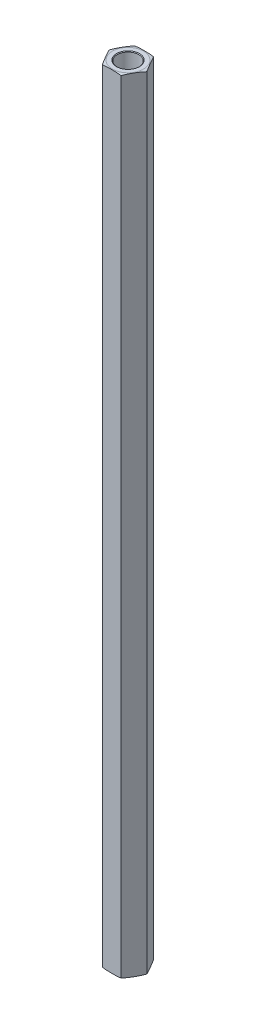
ISO-10303-21;
HEADER;
FILE_DESCRIPTION(('STEP AP214'),'2;1');
FILE_NAME('part.step','',(''),(''),'','','');
FILE_SCHEMA(('AUTOMOTIVE_DESIGN { 1 0 10303 214 1 1 1 1 }'));
ENDSEC;
DATA;
#1=APPLICATION_CONTEXT('core data for automotive mechanical design processes');
#2=APPLICATION_PROTOCOL_DEFINITION('international standard','automotive_design',2000,#1);
#3=PRODUCT_CONTEXT('',#1,'mechanical');
#4=PRODUCT('Part','Part','',(#3));
#5=PRODUCT_RELATED_PRODUCT_CATEGORY('part','',(#4));
#6=PRODUCT_DEFINITION_FORMATION('','',#4);
#7=PRODUCT_DEFINITION_CONTEXT('part definition',#1,'design');
#8=PRODUCT_DEFINITION('design','',#6,#7);
#9=PRODUCT_DEFINITION_SHAPE('','',#8);
#10=(LENGTH_UNIT() NAMED_UNIT(*) SI_UNIT(.MILLI.,.METRE.));
#11=(NAMED_UNIT(*) PLANE_ANGLE_UNIT() SI_UNIT($,.RADIAN.));
#12=(NAMED_UNIT(*) SI_UNIT($,.STERADIAN.) SOLID_ANGLE_UNIT());
#13=UNCERTAINTY_MEASURE_WITH_UNIT(LENGTH_MEASURE(1.E-05),#10,'distance_accuracy_value','');
#14=(GEOMETRIC_REPRESENTATION_CONTEXT(3) GLOBAL_UNCERTAINTY_ASSIGNED_CONTEXT((#13)) GLOBAL_UNIT_ASSIGNED_CONTEXT((#10,
#11,#12)) REPRESENTATION_CONTEXT('',''));
#15=CARTESIAN_POINT('',(0.,0.,0.));
#16=DIRECTION('',(0.,0.,1.));
#17=DIRECTION('',(1.,0.,0.));
#18=AXIS2_PLACEMENT_3D('',#15,#16,#17);
#19=CARTESIAN_POINT('',(0.,63.5,0.));
#20=DIRECTION('',(0.,1.,0.));
#21=DIRECTION('',(0.,0.,1.));
#22=AXIS2_PLACEMENT_3D('',#19,#20,#21);
#23=PLANE('',#22);
#24=CARTESIAN_POINT('',(0.,63.5,0.));
#25=DIRECTION('',(0.,1.,0.));
#26=DIRECTION('',(0.,0.,1.));
#27=AXIS2_PLACEMENT_3D('',#24,#25,#26);
#28=CIRCLE('',#27,2.0955);
#29=CARTESIAN_POINT('',(0.,63.5,2.0955));
#30=VERTEX_POINT('',#29);
#31=EDGE_CURVE('E302',#30,#30,#28,.T.);
#32=ORIENTED_EDGE('',*,*,#31,.T.);
#33=EDGE_LOOP('',(#32));
#34=FACE_BOUND('',#33,.T.);
#35=ADVANCED_FACE('F16',(#34),#23,.T.);
#36=CARTESIAN_POINT('',(0.,-63.5,0.));
#37=DIRECTION('',(0.,-1.,0.));
#38=DIRECTION('',(0.,0.,-1.));
#39=AXIS2_PLACEMENT_3D('',#36,#37,#38);
#40=PLANE('',#39);
#41=CARTESIAN_POINT('',(0.,-63.5,0.));
#42=DIRECTION('',(0.,-1.,0.));
#43=DIRECTION('',(0.,0.,-1.));
#44=AXIS2_PLACEMENT_3D('',#41,#42,#43);
#45=CIRCLE('',#44,2.0955);
#46=CARTESIAN_POINT('',(0.,-63.5,-2.0955));
#47=VERTEX_POINT('',#46);
#48=EDGE_CURVE('E312',#47,#47,#45,.T.);
#49=ORIENTED_EDGE('',*,*,#48,.T.);
#50=EDGE_LOOP('',(#49));
#51=FACE_BOUND('',#50,.T.);
#52=ADVANCED_FACE('F407',(#51),#40,.T.);
#53=CARTESIAN_POINT('',(0.,63.5,0.));
#54=DIRECTION('',(0.,1.,0.));
#55=DIRECTION('',(0.,0.,1.));
#56=AXIS2_PLACEMENT_3D('',#53,#54,#55);
#57=CYLINDRICAL_SURFACE('',#56,2.0955);
#58=CARTESIAN_POINT('',(0.,76.0729999999512,0.));
#59=DIRECTION('',(0.,1.,0.));
#60=DIRECTION('',(0.,0.,1.));
#61=AXIS2_PLACEMENT_3D('',#58,#59,#60);
#62=CIRCLE('',#61,2.09549999993897);
#63=CARTESIAN_POINT('',(0.,76.0729999999512,2.09549999993897));
#64=VERTEX_POINT('',#63);
#65=EDGE_CURVE('E314',#64,#64,#62,.T.);
#66=ORIENTED_EDGE('',*,*,#65,.T.);
#67=EDGE_LOOP('',(#66));
#68=FACE_BOUND('',#67,.T.);
#69=ORIENTED_EDGE('',*,*,#31,.F.);
#70=EDGE_LOOP('',(#69));
#71=FACE_BOUND('',#70,.T.);
#72=ADVANCED_FACE('F324',(#68,#71),#57,.F.);
#73=CARTESIAN_POINT('',(0.,-63.5,0.));
#74=DIRECTION('',(0.,-1.,0.));
#75=DIRECTION('',(0.,0.,-1.));
#76=AXIS2_PLACEMENT_3D('',#73,#74,#75);
#77=CYLINDRICAL_SURFACE('',#76,2.0955);
#78=ORIENTED_EDGE('',*,*,#48,.F.);
#79=EDGE_LOOP('',(#78));
#80=FACE_BOUND('',#79,.T.);
#81=CARTESIAN_POINT('',(0.,-76.0729999999512,0.));
#82=DIRECTION('',(0.,-1.,0.));
#83=DIRECTION('',(0.,0.,-1.));
#84=AXIS2_PLACEMENT_3D('',#81,#82,#83);
#85=CIRCLE('',#84,2.09550000005265);
#86=CARTESIAN_POINT('',(0.,-76.0729999999512,-2.09550000005265));
#87=VERTEX_POINT('',#86);
#88=EDGE_CURVE('E154',#87,#87,#85,.T.);
#89=ORIENTED_EDGE('',*,*,#88,.T.);
#90=EDGE_LOOP('',(#89));
#91=FACE_BOUND('',#90,.T.);
#92=ADVANCED_FACE('F329',(#80,#91),#77,.F.);
#93=CARTESIAN_POINT('',(0.,76.1999999999716,0.));
#94=DIRECTION('',(0.,1.,0.));
#95=DIRECTION('',(0.,0.,1.));
#96=AXIS2_PLACEMENT_3D('',#93,#94,#95);
#97=CONICAL_SURFACE('',#96,2.22249999995938,0.785398163397448);
#98=CARTESIAN_POINT('',(0.,76.2000000000285,0.));
#99=DIRECTION('',(0.,1.,0.));
#100=DIRECTION('',(0.,0.,1.));
#101=AXIS2_PLACEMENT_3D('',#98,#99,#100);
#102=CIRCLE('',#101,2.22250000001623);
#103=CARTESIAN_POINT('',(0.,76.2000000000285,2.22250000001623));
#104=VERTEX_POINT('',#103);
#105=EDGE_CURVE('E79',#104,#104,#102,.T.);
#106=ORIENTED_EDGE('',*,*,#105,.T.);
#107=EDGE_LOOP('',(#106));
#108=FACE_BOUND('',#107,.T.);
#109=ORIENTED_EDGE('',*,*,#65,.F.);
#110=EDGE_LOOP('',(#109));
#111=FACE_BOUND('',#110,.T.);
#112=ADVANCED_FACE('F327',(#108,#111),#97,.F.);
#113=CARTESIAN_POINT('',(-3.66617420935413,76.2,0.));
#114=DIRECTION('',(0.866025403784439,0.,-0.499999999999999));
#115=DIRECTION('',(-0.499999999999999,0.,-0.866025403784439));
#116=AXIS2_PLACEMENT_3D('',#113,#114,#115);
#117=PLANE('',#116);
#118=DIRECTION('',(0.,1.,0.));
#119=VECTOR('',#118,1.);
#120=CARTESIAN_POINT('',(-1.83308710467708,76.2,3.175));
#121=LINE('',#120,#119);
#122=CARTESIAN_POINT('',(-1.83308710467708,-76.073,3.17499999999999));
#123=VERTEX_POINT('',#122);
#124=CARTESIAN_POINT('',(-1.83308710467706,76.073,3.175));
#125=VERTEX_POINT('',#124);
#126=EDGE_CURVE('E75',#123,#125,#121,.T.);
#127=ORIENTED_EDGE('',*,*,#126,.T.);
#128=CARTESIAN_POINT('',(-3.66617420935412,76.073,0.));
#129=CARTESIAN_POINT('',(-3.62797961467393,76.0889014148997,0.0661549785605975));
#130=CARTESIAN_POINT('',(-3.58956810864153,76.1024886076105,0.132685658603946));
#131=CARTESIAN_POINT('',(-3.51249051795704,76.1258161979402,0.266187961794493));
#132=CARTESIAN_POINT('',(-3.47382473049837,76.1355604771397,0.333159070187556));
#133=CARTESIAN_POINT('',(-3.3964163186786,76.1519966530451,0.467234372392611));
#134=CARTESIAN_POINT('',(-3.35767399633298,76.1586945328669,0.534338043098447));
#135=CARTESIAN_POINT('',(-3.28009834620095,76.1697767572932,0.668703010557309));
#136=CARTESIAN_POINT('',(-3.24126499587751,76.1741604504739,0.735964346345629));
#137=CARTESIAN_POINT('',(-3.16354065964291,76.1812403004263,0.870586845688525));
#138=CARTESIAN_POINT('',(-3.1246496537445,76.1839355237591,0.937948043862028));
#139=CARTESIAN_POINT('',(-3.04685144594563,76.1881531983713,1.07269849250747));
#140=CARTESIAN_POINT('',(-3.00794424351938,76.1896756080272,1.14008774389011));
#141=CARTESIAN_POINT('',(-2.93051517598838,76.191922705889,1.27419882283648));
#142=CARTESIAN_POINT('',(-2.89199336248897,76.1926552468181,1.34092056101714));
#143=CARTESIAN_POINT('',(-2.81494778346103,76.1935767302574,1.47436741839211));
#144=CARTESIAN_POINT('',(-2.77642401791397,76.1937656658949,1.54109253761849));
#145=CARTESIAN_POINT('',(-2.69935964430966,76.1936659966805,1.67457194815462));
#146=CARTESIAN_POINT('',(-2.66081903631773,76.1933771811765,1.74132623935123));
#147=CARTESIAN_POINT('',(-2.58373908085278,76.192221986219,1.87483263846168));
#148=CARTESIAN_POINT('',(-2.54519973341192,76.1913555970385,1.9415847463198));
#149=CARTESIAN_POINT('',(-2.46812969629714,76.1887861940656,2.07507396634382));
#150=CARTESIAN_POINT('',(-2.42959900625906,76.1870832271616,2.14181107914046));
#151=CARTESIAN_POINT('',(-2.35255651340846,76.1824387229725,2.27525259109946));
#152=CARTESIAN_POINT('',(-2.31404470975378,76.1794972471357,2.34195699172048));
#153=CARTESIAN_POINT('',(-2.25084206239882,76.1732174124748,2.45142718811213));
#154=CARTESIAN_POINT('',(-2.22613849336951,76.1703980110462,2.49421502479918));
#155=CARTESIAN_POINT('',(-2.17676945272177,76.1638696794303,2.57972471152201));
#156=CARTESIAN_POINT('',(-2.15210397034136,76.1601610809138,2.62244658019807));
#157=CARTESIAN_POINT('',(-2.10282753811656,76.1516802711496,2.70779586442715));
#158=CARTESIAN_POINT('',(-2.07821657107493,76.1469084657008,2.75042330976666));
#159=CARTESIAN_POINT('',(-2.02900094683521,76.1360987712515,2.83566727147607));
#160=CARTESIAN_POINT('',(-2.00439646085438,76.1300577313084,2.87828349128898));
#161=CARTESIAN_POINT('',(-1.95527325900916,76.1165138354161,2.96336737271537));
#162=CARTESIAN_POINT('',(-1.930754596176,76.1090101978029,3.00583494247605));
#163=CARTESIAN_POINT('',(-1.88182157373165,76.0923203507084,3.09058942351758));
#164=CARTESIAN_POINT('',(-1.85740744053267,76.0831314978033,3.13287594264096));
#165=CARTESIAN_POINT('',(-1.83308710467707,76.073,3.175));
#166=B_SPLINE_CURVE_WITH_KNOTS('',3,(#128,#129,#130,#131,#132,#133,#134,#135,#136,#137,#138,
#139,#140,#141,#142,#143,#144,#145,#146,#147,#148,#149,#150,#151,#152,#153,#154,#155,#156,#157,
#158,#159,#160,#161,#162,#163,#164,#165),.UNSPECIFIED.,.F.,.F.,(4,2,2,2,2,2,2,2,2,2,2,2,2,2,2,2,
2,2,4),(0.,0.233977307818051,0.467717675040913,0.700996973557829,0.934341903230191,
1.16781571967295,1.40129782179891,1.63243665809747,1.86357841666705,2.09482211846393,
2.32606971471605,2.55730435147518,2.78852751694545,2.93698369265197,3.08538458004561,
3.2337289233465,3.38244598546656,3.53124274626105,3.68027493713584),.UNSPECIFIED.);
#167=CARTESIAN_POINT('',(-3.66617420935413,76.073,0.));
#168=VERTEX_POINT('',#167);
#169=EDGE_CURVE('E68',#168,#125,#166,.T.);
#170=ORIENTED_EDGE('',*,*,#169,.F.);
#171=DIRECTION('',(0.,1.,0.));
#172=VECTOR('',#171,1.);
#173=CARTESIAN_POINT('',(-3.66617420935413,76.2,0.));
#174=LINE('',#173,#172);
#175=CARTESIAN_POINT('',(-3.66617420935413,-76.073,0.));
#176=VERTEX_POINT('',#175);
#177=EDGE_CURVE('E72',#168,#176,#174,.F.);
#178=ORIENTED_EDGE('',*,*,#177,.T.);
#179=CARTESIAN_POINT('',(-1.83308710467708,-76.073,3.17499999999999));
#180=CARTESIAN_POINT('',(-1.87128169935727,-76.0889014148997,3.1088450214394));
#181=CARTESIAN_POINT('',(-1.90969320538966,-76.1024886076105,3.04231434139605));
#182=CARTESIAN_POINT('',(-1.98677079607416,-76.1258161979402,2.9088120382055));
#183=CARTESIAN_POINT('',(-2.02543658353282,-76.1355604771397,2.84184092981244));
#184=CARTESIAN_POINT('',(-2.10284499535259,-76.1519966530451,2.70776562760738));
#185=CARTESIAN_POINT('',(-2.14158731769822,-76.1586945328669,2.64066195690155));
#186=CARTESIAN_POINT('',(-2.21916296783025,-76.1697767572932,2.50629698944268));
#187=CARTESIAN_POINT('',(-2.25799631815369,-76.1741604504739,2.43903565365436));
#188=CARTESIAN_POINT('',(-2.33572065438829,-76.1812403004263,2.30441315431147));
#189=CARTESIAN_POINT('',(-2.37461166028669,-76.1839355237591,2.23705195613796));
#190=CARTESIAN_POINT('',(-2.45240986808556,-76.1881531983713,2.10230150749252));
#191=CARTESIAN_POINT('',(-2.49131707051182,-76.1896756080272,2.03491225610988));
#192=CARTESIAN_POINT('',(-2.56874613804282,-76.191922705889,1.90080117716351));
#193=CARTESIAN_POINT('',(-2.60726795154222,-76.1926552468181,1.83407943898285));
#194=CARTESIAN_POINT('',(-2.68431353057017,-76.1935767302574,1.70063258160788));
#195=CARTESIAN_POINT('',(-2.72283729611723,-76.1937656658949,1.6339074623815));
#196=CARTESIAN_POINT('',(-2.79990166972153,-76.1936659966805,1.50042805184538));
#197=CARTESIAN_POINT('',(-2.83844227771346,-76.1933771811765,1.43367376064876));
#198=CARTESIAN_POINT('',(-2.91552223317841,-76.192221986219,1.30016736153832));
#199=CARTESIAN_POINT('',(-2.95406158061928,-76.1913555970385,1.23341525368019));
#200=CARTESIAN_POINT('',(-3.03113161773406,-76.1887861940656,1.09992603365617));
#201=CARTESIAN_POINT('',(-3.06966230777213,-76.1870832271616,1.03318892085954));
#202=CARTESIAN_POINT('',(-3.14670480062273,-76.1824387229725,0.899747408900532));
#203=CARTESIAN_POINT('',(-3.18521660427741,-76.1794972471357,0.833043008279515));
#204=CARTESIAN_POINT('',(-3.24841925163237,-76.1732174124748,0.723572811887864));
#205=CARTESIAN_POINT('',(-3.27312282066168,-76.1703980110462,0.680784975200813));
#206=CARTESIAN_POINT('',(-3.32249186130943,-76.1638696794303,0.595275288477983));
#207=CARTESIAN_POINT('',(-3.34715734368984,-76.1601610809138,0.552553419801923));
#208=CARTESIAN_POINT('',(-3.39643377591464,-76.1516802711496,0.467204135572843));
#209=CARTESIAN_POINT('',(-3.42104474295627,-76.1469084657008,0.424576690233332));
#210=CARTESIAN_POINT('',(-3.47026036719599,-76.1360987712515,0.33933272852392));
#211=CARTESIAN_POINT('',(-3.49486485317681,-76.1300577313083,0.296716508711013));
#212=CARTESIAN_POINT('',(-3.54398805502204,-76.1165138354161,0.211632627284621));
#213=CARTESIAN_POINT('',(-3.5685067178552,-76.1090101978029,0.169165057523944));
#214=CARTESIAN_POINT('',(-3.61743974029955,-76.0923203507084,0.0844105764824117));
#215=CARTESIAN_POINT('',(-3.64185387349853,-76.0831314978033,0.042124057359026));
#216=CARTESIAN_POINT('',(-3.66617420935413,-76.073,0.));
#217=B_SPLINE_CURVE_WITH_KNOTS('',3,(#179,#180,#181,#182,#183,#184,#185,#186,#187,#188,#189,
#190,#191,#192,#193,#194,#195,#196,#197,#198,#199,#200,#201,#202,#203,#204,#205,#206,#207,#208,
#209,#210,#211,#212,#213,#214,#215,#216),.UNSPECIFIED.,.F.,.F.,(4,2,2,2,2,2,2,2,2,2,2,2,2,2,2,2,
2,2,4),(0.,0.233977307818054,0.467717675040914,0.70099697355783,0.934341903230193,
1.16781571967295,1.40129782179891,1.63243665809747,1.86357841666705,2.09482211846393,
2.32606971471605,2.55730435147519,2.78852751694545,2.93698369265197,3.08538458004561,
3.2337289233465,3.38244598546656,3.53124274626106,3.68027493713584),.UNSPECIFIED.);
#218=EDGE_CURVE('E87',#123,#176,#217,.T.);
#219=ORIENTED_EDGE('',*,*,#218,.F.);
#220=EDGE_LOOP('',(#127,#170,#178,#219));
#221=FACE_BOUND('',#220,.T.);
#222=ADVANCED_FACE('F70',(#221),#117,.F.);
#223=CARTESIAN_POINT('',(0.,-76.1999999998579,0.));
#224=DIRECTION('',(0.,-1.,0.));
#225=DIRECTION('',(0.,0.,-1.));
#226=AXIS2_PLACEMENT_3D('',#223,#224,#225);
#227=CONICAL_SURFACE('',#226,2.22249999995938,0.785398163397448);
#228=ORIENTED_EDGE('',*,*,#88,.F.);
#229=EDGE_LOOP('',(#228));
#230=FACE_BOUND('',#229,.T.);
#231=CARTESIAN_POINT('',(0.,-76.1999999999716,0.));
#232=DIRECTION('',(0.,-1.,0.));
#233=DIRECTION('',(0.,0.,-1.));
#234=AXIS2_PLACEMENT_3D('',#231,#232,#233);
#235=CIRCLE('',#234,2.22250000007307);
#236=CARTESIAN_POINT('',(0.,-76.1999999999716,-2.22250000007307));
#237=VERTEX_POINT('',#236);
#238=EDGE_CURVE('E278',#237,#237,#235,.F.);
#239=ORIENTED_EDGE('',*,*,#238,.F.);
#240=EDGE_LOOP('',(#239));
#241=FACE_BOUND('',#240,.T.);
#242=ADVANCED_FACE('F336',(#230,#241),#227,.F.);
#243=CARTESIAN_POINT('',(-1.83308710467707,76.2,-3.175));
#244=DIRECTION('',(0.,-1.,0.));
#245=DIRECTION('',(0.,0.,-1.));
#246=AXIS2_PLACEMENT_3D('',#243,#244,#245);
#247=PLANE('',#246);
#248=CARTESIAN_POINT('',(0.,76.2,0.));
#249=DIRECTION('',(0.,-1.,0.));
#250=DIRECTION('',(0.,0.,1.));
#251=AXIS2_PLACEMENT_3D('',#248,#249,#250);
#252=CIRCLE('',#251,3.03117420935412);
#253=CARTESIAN_POINT('',(0.,76.2,3.03117420935411));
#254=VERTEX_POINT('',#253);
#255=CARTESIAN_POINT('',(0.,76.2,-3.03117420935411));
#256=VERTEX_POINT('',#255);
#257=EDGE_CURVE('E78',#254,#256,#252,.T.);
#258=ORIENTED_EDGE('',*,*,#257,.F.);
#259=CARTESIAN_POINT('',(0.,76.2,0.));
#260=DIRECTION('',(0.,-1.,0.));
#261=DIRECTION('',(0.,0.,-1.));
#262=AXIS2_PLACEMENT_3D('',#259,#260,#261);
#263=CIRCLE('',#262,3.03117420935412);
#264=EDGE_CURVE('E139',#256,#254,#263,.T.);
#265=ORIENTED_EDGE('',*,*,#264,.F.);
#266=EDGE_LOOP('',(#258,#265));
#267=FACE_BOUND('',#266,.T.);
#268=ORIENTED_EDGE('',*,*,#105,.F.);
#269=EDGE_LOOP('',(#268));
#270=FACE_BOUND('',#269,.T.);
#271=ADVANCED_FACE('F115',(#267,#270),#247,.F.);
#272=CARTESIAN_POINT('',(-1.83308710467707,76.2,-3.175));
#273=DIRECTION('',(0.866025403784439,0.,0.5));
#274=DIRECTION('',(0.5,0.,-0.866025403784439));
#275=AXIS2_PLACEMENT_3D('',#272,#273,#274);
#276=PLANE('',#275);
#277=ORIENTED_EDGE('',*,*,#177,.F.);
#278=CARTESIAN_POINT('',(-1.83308710467706,76.073,-3.17500000000001));
#279=CARTESIAN_POINT('',(-1.87128169935725,76.0889014148997,-3.10884502143942));
#280=CARTESIAN_POINT('',(-1.90969320538965,76.1024886076105,-3.04231434139607));
#281=CARTESIAN_POINT('',(-1.98677079607414,76.1258161979402,-2.90881203820553));
#282=CARTESIAN_POINT('',(-2.0254365835328,76.1355604771397,-2.84184092981247));
#283=CARTESIAN_POINT('',(-2.10284499535257,76.1519966530451,-2.70776562760742));
#284=CARTESIAN_POINT('',(-2.1415873176982,76.1586945328669,-2.64066195690159));
#285=CARTESIAN_POINT('',(-2.21916296783022,76.1697767572932,-2.50629698944273));
#286=CARTESIAN_POINT('',(-2.25799631815366,76.1741604504739,-2.43903565365441));
#287=CARTESIAN_POINT('',(-2.33572065438826,76.1812403004263,-2.30441315431152));
#288=CARTESIAN_POINT('',(-2.37461166028667,76.1839355237591,-2.23705195613802));
#289=CARTESIAN_POINT('',(-2.45240986808553,76.1881531983713,-2.10230150749258));
#290=CARTESIAN_POINT('',(-2.49131707051179,76.1896756080272,-2.03491225610994));
#291=CARTESIAN_POINT('',(-2.56874613804278,76.191922705889,-1.90080117716357));
#292=CARTESIAN_POINT('',(-2.60726795154219,76.1926552468181,-1.83407943898291));
#293=CARTESIAN_POINT('',(-2.68431353057013,76.1935767302574,-1.70063258160795));
#294=CARTESIAN_POINT('',(-2.72283729611719,76.1937656658949,-1.63390746238157));
#295=CARTESIAN_POINT('',(-2.79990166972149,76.1936659966805,-1.50042805184545));
#296=CARTESIAN_POINT('',(-2.83844227771342,76.1933771811765,-1.43367376064884));
#297=CARTESIAN_POINT('',(-2.91552223317837,76.192221986219,-1.3001673615384));
#298=CARTESIAN_POINT('',(-2.95406158061923,76.1913555970385,-1.23341525368027));
#299=CARTESIAN_POINT('',(-3.03113161773401,76.1887861940656,-1.09992603365625));
#300=CARTESIAN_POINT('',(-3.06966230777209,76.1870832271616,-1.03318892085962));
#301=CARTESIAN_POINT('',(-3.14670480062269,76.1824387229725,-0.899747408900623));
#302=CARTESIAN_POINT('',(-3.18521660427736,76.1794972471357,-0.833043008279609));
#303=CARTESIAN_POINT('',(-3.24841925163232,76.1732174124748,-0.723572811887956));
#304=CARTESIAN_POINT('',(-3.27312282066164,76.1703980110462,-0.6807849752009));
#305=CARTESIAN_POINT('',(-3.32249186130939,76.1638696794303,-0.595275288478059));
#306=CARTESIAN_POINT('',(-3.3471573436898,76.1601610809138,-0.552553419801995));
#307=CARTESIAN_POINT('',(-3.39643377591461,76.1516802711496,-0.467204135572906));
#308=CARTESIAN_POINT('',(-3.42104474295624,76.1469084657008,-0.424576690233391));
#309=CARTESIAN_POINT('',(-3.47026036719597,76.1360987712515,-0.339332728523969));
#310=CARTESIAN_POINT('',(-3.49486485317679,76.1300577313084,-0.296716508711057));
#311=CARTESIAN_POINT('',(-3.54398805502203,76.1165138354161,-0.211632627284654));
#312=CARTESIAN_POINT('',(-3.56850671785518,76.1090101978029,-0.169165057523973));
#313=CARTESIAN_POINT('',(-3.61743974029955,76.0923203507084,-0.084410576482432));
#314=CARTESIAN_POINT('',(-3.64185387349853,76.0831314978033,-0.0421240573590423));
#315=CARTESIAN_POINT('',(-3.66617420935413,76.073,0.));
#316=B_SPLINE_CURVE_WITH_KNOTS('',3,(#278,#279,#280,#281,#282,#283,#284,#285,#286,#287,#288,
#289,#290,#291,#292,#293,#294,#295,#296,#297,#298,#299,#300,#301,#302,#303,#304,#305,#306,#307,
#308,#309,#310,#311,#312,#313,#314,#315),.UNSPECIFIED.,.F.,.F.,(4,2,2,2,2,2,2,2,2,2,2,2,2,2,2,2,
2,2,4),(0.,0.233977307818047,0.4677176750409,0.700996973557809,0.934341903230164,
1.16781571967292,1.40129782179887,1.63243665809742,1.863578416667,2.09482211846387,
2.32606971471598,2.55730435147511,2.78852751694536,2.9369836926519,3.08538458004556,
3.23372892334647,3.38244598546655,3.53124274626106,3.68027493713586),.UNSPECIFIED.);
#317=CARTESIAN_POINT('',(-1.83308710467705,76.073,-3.17500000000001));
#318=VERTEX_POINT('',#317);
#319=EDGE_CURVE('E84',#318,#168,#316,.T.);
#320=ORIENTED_EDGE('',*,*,#319,.F.);
#321=DIRECTION('',(0.,1.,0.));
#322=VECTOR('',#321,1.);
#323=CARTESIAN_POINT('',(-1.83308710467705,76.2,-3.175));
#324=LINE('',#323,#322);
#325=CARTESIAN_POINT('',(-1.83308710467708,-76.073,-3.175));
#326=VERTEX_POINT('',#325);
#327=EDGE_CURVE('E177',#318,#326,#324,.F.);
#328=ORIENTED_EDGE('',*,*,#327,.T.);
#329=CARTESIAN_POINT('',(-3.66617420935413,-76.073,0.));
#330=CARTESIAN_POINT('',(-3.62797961467394,-76.0889014148997,-0.0661549785605842));
#331=CARTESIAN_POINT('',(-3.58956810864155,-76.1024886076105,-0.132685658603931));
#332=CARTESIAN_POINT('',(-3.51249051795705,-76.1258161979402,-0.266187961794475));
#333=CARTESIAN_POINT('',(-3.47382473049839,-76.1355604771397,-0.333159070187536));
#334=CARTESIAN_POINT('',(-3.39641631867862,-76.1519966530451,-0.467234372392588));
#335=CARTESIAN_POINT('',(-3.357673996333,-76.1586945328669,-0.534338043098422));
#336=CARTESIAN_POINT('',(-3.28009834620097,-76.1697767572932,-0.668703010557281));
#337=CARTESIAN_POINT('',(-3.24126499587753,-76.1741604504739,-0.735964346345599));
#338=CARTESIAN_POINT('',(-3.16354065964293,-76.1812403004263,-0.870586845688492));
#339=CARTESIAN_POINT('',(-3.12464965374452,-76.1839355237591,-0.937948043861994));
#340=CARTESIAN_POINT('',(-3.04685144594566,-76.1881531983713,-1.07269849250743));
#341=CARTESIAN_POINT('',(-3.0079442435194,-76.1896756080272,-1.14008774389007));
#342=CARTESIAN_POINT('',(-2.93051517598841,-76.191922705889,-1.27419882283644));
#343=CARTESIAN_POINT('',(-2.891993362489,-76.1926552468181,-1.3409205610171));
#344=CARTESIAN_POINT('',(-2.81494778346106,-76.1935767302574,-1.47436741839206));
#345=CARTESIAN_POINT('',(-2.776424017914,-76.1937656658949,-1.54109253761844));
#346=CARTESIAN_POINT('',(-2.6993596443097,-76.1936659966805,-1.67457194815457));
#347=CARTESIAN_POINT('',(-2.66081903631777,-76.1933771811765,-1.74132623935118));
#348=CARTESIAN_POINT('',(-2.58373908085282,-76.192221986219,-1.87483263846162));
#349=CARTESIAN_POINT('',(-2.54519973341195,-76.1913555970385,-1.94158474631974));
#350=CARTESIAN_POINT('',(-2.46812969629717,-76.1887861940656,-2.07507396634376));
#351=CARTESIAN_POINT('',(-2.4295990062591,-76.1870832271616,-2.14181107914039));
#352=CARTESIAN_POINT('',(-2.3525565134085,-76.1824387229725,-2.27525259109939));
#353=CARTESIAN_POINT('',(-2.31404470975383,-76.1794972471357,-2.34195699172041));
#354=CARTESIAN_POINT('',(-2.25084206239887,-76.1732174124748,-2.45142718811206));
#355=CARTESIAN_POINT('',(-2.22613849336955,-76.1703980110462,-2.49421502479912));
#356=CARTESIAN_POINT('',(-2.1767694527218,-76.1638696794303,-2.57972471152195));
#357=CARTESIAN_POINT('',(-2.15210397034139,-76.1601610809138,-2.62244658019802));
#358=CARTESIAN_POINT('',(-2.10282753811659,-76.1516802711496,-2.7077958644271));
#359=CARTESIAN_POINT('',(-2.07821657107495,-76.1469084657008,-2.75042330976661));
#360=CARTESIAN_POINT('',(-2.02900094683523,-76.1360987712515,-2.83566727147603));
#361=CARTESIAN_POINT('',(-2.0043964608544,-76.1300577313084,-2.87828349128894));
#362=CARTESIAN_POINT('',(-1.95527325900917,-76.1165138354161,-2.96336737271534));
#363=CARTESIAN_POINT('',(-1.93075459617602,-76.1090101978029,-3.00583494247602));
#364=CARTESIAN_POINT('',(-1.88182157373166,-76.0923203507084,-3.09058942351756));
#365=CARTESIAN_POINT('',(-1.85740744053268,-76.0831314978033,-3.13287594264095));
#366=CARTESIAN_POINT('',(-1.83308710467707,-76.073,-3.17499999999999));
#367=B_SPLINE_CURVE_WITH_KNOTS('',3,(#329,#330,#331,#332,#333,#334,#335,#336,#337,#338,#339,
#340,#341,#342,#343,#344,#345,#346,#347,#348,#349,#350,#351,#352,#353,#354,#355,#356,#357,#358,
#359,#360,#361,#362,#363,#364,#365,#366),.UNSPECIFIED.,.F.,.F.,(4,2,2,2,2,2,2,2,2,2,2,2,2,2,2,2,
2,2,4),(0.,0.233977307818045,0.467717675040901,0.700996973557812,0.934341903230169,
1.16781571967292,1.40129782179888,1.63243665809743,1.86357841666701,2.09482211846388,
2.32606971471599,2.55730435147512,2.78852751694538,2.93698369265191,3.08538458004557,
3.23372892334647,3.38244598546654,3.53124274626104,3.68027493713584),.UNSPECIFIED.);
#368=EDGE_CURVE('E86',#176,#326,#367,.T.);
#369=ORIENTED_EDGE('',*,*,#368,.F.);
#370=EDGE_LOOP('',(#277,#320,#328,#369));
#371=FACE_BOUND('',#370,.T.);
#372=ADVANCED_FACE('F82',(#371),#276,.F.);
#373=CARTESIAN_POINT('',(-1.83308710467707,76.2,3.175));
#374=DIRECTION('',(0.,0.,-1.));
#375=DIRECTION('',(-1.,0.,0.));
#376=AXIS2_PLACEMENT_3D('',#373,#374,#375);
#377=PLANE('',#376);
#378=DIRECTION('',(0.,1.,0.));
#379=VECTOR('',#378,1.);
#380=CARTESIAN_POINT('',(1.83308710467706,76.2,3.17499999999999));
#381=LINE('',#380,#379);
#382=CARTESIAN_POINT('',(1.83308710467706,-76.073,3.17499999999999));
#383=VERTEX_POINT('',#382);
#384=CARTESIAN_POINT('',(1.83308710467706,76.073,3.17499999999999));
#385=VERTEX_POINT('',#384);
#386=EDGE_CURVE('E179',#383,#385,#381,.T.);
#387=ORIENTED_EDGE('',*,*,#386,.T.);
#388=CARTESIAN_POINT('',(-1.83308710467706,76.073,3.175));
#389=CARTESIAN_POINT('',(-1.73237579828683,76.0939400141518,3.175));
#390=CARTESIAN_POINT('',(-1.63096506893486,76.1108853495327,3.175));
#391=CARTESIAN_POINT('',(-1.42767146651469,76.1384971643984,3.175));
#392=CARTESIAN_POINT('',(-1.32579191427254,76.1491875658753,3.175));
#393=CARTESIAN_POINT('',(-1.12177634709138,76.1661280408079,3.175));
#394=CARTESIAN_POINT('',(-1.0196405664338,76.1723812707188,3.175));
#395=CARTESIAN_POINT('',(-0.815663681397375,76.1819028064183,3.175));
#396=CARTESIAN_POINT('',(-0.713823115514573,76.1851834044999,3.175));
#397=CARTESIAN_POINT('',(-0.510018485441651,76.1899454848703,3.175));
#398=CARTESIAN_POINT('',(-0.408054390577976,76.1914254100882,3.175));
#399=CARTESIAN_POINT('',(-0.20406020033787,76.1933146818379,3.175));
#400=CARTESIAN_POINT('',(-0.102030100168935,76.1937234241492,3.175));
#401=CARTESIAN_POINT('',(0.102030100168935,76.1937234241492,3.175));
#402=CARTESIAN_POINT('',(0.20406020033787,76.1933146818379,3.175));
#403=CARTESIAN_POINT('',(0.408054390577977,76.1914254100882,3.17499999999999));
#404=CARTESIAN_POINT('',(0.510018485441652,76.1899454848703,3.17499999999999));
#405=CARTESIAN_POINT('',(0.713823115514574,76.1851834044999,3.17499999999999));
#406=CARTESIAN_POINT('',(0.815663681397377,76.1819028064183,3.17499999999999));
#407=CARTESIAN_POINT('',(1.0196405664338,76.1723812707188,3.17499999999999));
#408=CARTESIAN_POINT('',(1.12177634709138,76.1661280408079,3.17499999999999));
#409=CARTESIAN_POINT('',(1.32579191427254,76.1491875658753,3.17499999999999));
#410=CARTESIAN_POINT('',(1.42767146651469,76.1384971643984,3.17499999999999));
#411=CARTESIAN_POINT('',(1.63096506893486,76.1108853495327,3.17499999999999));
#412=CARTESIAN_POINT('',(1.73237579828684,76.0939400141518,3.17499999999999));
#413=CARTESIAN_POINT('',(1.83308710467706,76.073,3.17499999999999));
#414=B_SPLINE_CURVE_WITH_KNOTS('',3,(#388,#389,#390,#391,#392,#393,#394,#395,#396,#397,#398,
#399,#400,#401,#402,#403,#404,#405,#406,#407,#408,#409,#410,#411,#412,#413),.UNSPECIFIED.,.F.,
.F.,(4,2,2,2,2,2,2,2,2,2,2,2,4),(0.,0.308333242342805,0.615479423308232,0.922406891130007,
1.2280592962085,1.53397581645216,1.84006485747889,2.14615389850561,2.45207041874927,
2.75772282382777,3.06465029164954,3.37179647261497,3.68012971495778),.UNSPECIFIED.);
#415=EDGE_CURVE('E273',#125,#385,#414,.T.);
#416=ORIENTED_EDGE('',*,*,#415,.F.);
#417=ORIENTED_EDGE('',*,*,#126,.F.);
#418=CARTESIAN_POINT('',(1.83308710467706,-76.073,3.17499999999999));
#419=CARTESIAN_POINT('',(1.73237579828684,-76.0939400141518,3.17499999999999));
#420=CARTESIAN_POINT('',(1.63096506893486,-76.1108853495327,3.17499999999999));
#421=CARTESIAN_POINT('',(1.4276714665147,-76.1384971643984,3.17499999999999));
#422=CARTESIAN_POINT('',(1.32579191427254,-76.1491875658753,3.17499999999999));
#423=CARTESIAN_POINT('',(1.12177634709138,-76.1661280408079,3.17499999999999));
#424=CARTESIAN_POINT('',(1.0196405664338,-76.1723812707188,3.17499999999999));
#425=CARTESIAN_POINT('',(0.815663681397376,-76.1819028064183,3.17499999999999));
#426=CARTESIAN_POINT('',(0.713823115514574,-76.1851834044999,3.17499999999999));
#427=CARTESIAN_POINT('',(0.510018485441651,-76.1899454848703,3.17499999999999));
#428=CARTESIAN_POINT('',(0.408054390577975,-76.1914254100882,3.175));
#429=CARTESIAN_POINT('',(0.204060200337868,-76.1933146818379,3.17499999999999));
#430=CARTESIAN_POINT('',(0.102030100168933,-76.1937234241492,3.17499999999999));
#431=CARTESIAN_POINT('',(-0.102030100168939,-76.1937234241492,3.17499999999999));
#432=CARTESIAN_POINT('',(-0.204060200337874,-76.1933146818379,3.175));
#433=CARTESIAN_POINT('',(-0.408054390577982,-76.1914254100882,3.175));
#434=CARTESIAN_POINT('',(-0.510018485441658,-76.1899454848703,3.175));
#435=CARTESIAN_POINT('',(-0.713823115514581,-76.1851834044999,3.175));
#436=CARTESIAN_POINT('',(-0.815663681397385,-76.1819028064183,3.175));
#437=CARTESIAN_POINT('',(-1.01964056643381,-76.1723812707188,3.175));
#438=CARTESIAN_POINT('',(-1.12177634709139,-76.1661280408079,3.175));
#439=CARTESIAN_POINT('',(-1.32579191427255,-76.1491875658753,3.175));
#440=CARTESIAN_POINT('',(-1.42767146651471,-76.1384971643984,3.175));
#441=CARTESIAN_POINT('',(-1.63096506893487,-76.1108853495327,3.175));
#442=CARTESIAN_POINT('',(-1.73237579828685,-76.0939400141518,3.175));
#443=CARTESIAN_POINT('',(-1.83308710467708,-76.073,3.175));
#444=B_SPLINE_CURVE_WITH_KNOTS('',3,(#418,#419,#420,#421,#422,#423,#424,#425,#426,#427,#428,
#429,#430,#431,#432,#433,#434,#435,#436,#437,#438,#439,#440,#441,#442,#443),.UNSPECIFIED.,.F.,
.F.,(4,2,2,2,2,2,2,2,2,2,2,2,4),(0.,0.308333242342807,0.615479423308235,0.922406891130011,
1.2280592962085,1.53397581645217,1.84006485747889,2.14615389850562,2.45207041874929,
2.75772282382778,3.06465029164956,3.37179647261499,3.6801297149578),.UNSPECIFIED.);
#445=EDGE_CURVE('E250',#383,#123,#444,.T.);
#446=ORIENTED_EDGE('',*,*,#445,.F.);
#447=EDGE_LOOP('',(#387,#416,#417,#446));
#448=FACE_BOUND('',#447,.T.);
#449=ADVANCED_FACE('F203',(#448),#377,.F.);
#450=CARTESIAN_POINT('',(-1.83308710467707,-76.2,-3.175));
#451=DIRECTION('',(0.,-1.,0.));
#452=DIRECTION('',(0.,0.,-1.));
#453=AXIS2_PLACEMENT_3D('',#450,#451,#452);
#454=PLANE('',#453);
#455=CARTESIAN_POINT('',(0.,-76.2,0.));
#456=DIRECTION('',(0.,1.,0.));
#457=DIRECTION('',(0.,0.,1.));
#458=AXIS2_PLACEMENT_3D('',#455,#456,#457);
#459=CIRCLE('',#458,3.03117420935408);
#460=CARTESIAN_POINT('',(0.,-76.2,3.0311742093541));
#461=VERTEX_POINT('',#460);
#462=CARTESIAN_POINT('',(0.,-76.2,-3.0311742093541));
#463=VERTEX_POINT('',#462);
#464=EDGE_CURVE('E189',#461,#463,#459,.T.);
#465=ORIENTED_EDGE('',*,*,#464,.F.);
#466=CARTESIAN_POINT('',(0.,-76.2,0.));
#467=DIRECTION('',(0.,1.,0.));
#468=DIRECTION('',(0.,0.,-1.));
#469=AXIS2_PLACEMENT_3D('',#466,#467,#468);
#470=CIRCLE('',#469,3.03117420935408);
#471=EDGE_CURVE('E182',#461,#463,#470,.F.);
#472=ORIENTED_EDGE('',*,*,#471,.T.);
#473=EDGE_LOOP('',(#465,#472));
#474=FACE_BOUND('',#473,.T.);
#475=ORIENTED_EDGE('',*,*,#238,.T.);
#476=EDGE_LOOP('',(#475));
#477=FACE_BOUND('',#476,.T.);
#478=ADVANCED_FACE('F194',(#474,#477),#454,.T.);
#479=CARTESIAN_POINT('',(1.83308710467706,76.2,3.17499999999999));
#480=DIRECTION('',(-0.866025403784439,0.,-0.5));
#481=DIRECTION('',(-0.5,0.,0.866025403784439));
#482=AXIS2_PLACEMENT_3D('',#479,#480,#481);
#483=PLANE('',#482);
#484=DIRECTION('',(0.,1.,0.));
#485=VECTOR('',#484,1.);
#486=CARTESIAN_POINT('',(3.66617420935412,76.2,0.));
#487=LINE('',#486,#485);
#488=CARTESIAN_POINT('',(3.66617420935412,-76.073,0.));
#489=VERTEX_POINT('',#488);
#490=CARTESIAN_POINT('',(3.66617420935412,76.073,0.));
#491=VERTEX_POINT('',#490);
#492=EDGE_CURVE('E235',#489,#491,#487,.T.);
#493=ORIENTED_EDGE('',*,*,#492,.T.);
#494=CARTESIAN_POINT('',(1.83308710467706,76.073,3.17499999999999));
#495=CARTESIAN_POINT('',(1.87128169935726,76.0889014148997,3.1088450214394));
#496=CARTESIAN_POINT('',(1.90969320538965,76.1024886076105,3.04231434139605));
#497=CARTESIAN_POINT('',(1.98677079607415,76.1258161979402,2.9088120382055));
#498=CARTESIAN_POINT('',(2.02543658353281,76.1355604771397,2.84184092981244));
#499=CARTESIAN_POINT('',(2.10284499535258,76.1519966530451,2.70776562760738));
#500=CARTESIAN_POINT('',(2.14158731769821,76.1586945328669,2.64066195690155));
#501=CARTESIAN_POINT('',(2.21916296783024,76.1697767572932,2.50629698944269));
#502=CARTESIAN_POINT('',(2.25799631815368,76.1741604504739,2.43903565365437));
#503=CARTESIAN_POINT('',(2.33572065438828,76.1812403004263,2.30441315431147));
#504=CARTESIAN_POINT('',(2.37461166028669,76.1839355237591,2.23705195613797));
#505=CARTESIAN_POINT('',(2.45240986808556,76.1881531983714,2.10230150749252));
#506=CARTESIAN_POINT('',(2.49131707051181,76.1896756080272,2.03491225610988));
#507=CARTESIAN_POINT('',(2.56874613804281,76.191922705889,1.90080117716351));
#508=CARTESIAN_POINT('',(2.60726795154221,76.1926552468181,1.83407943898285));
#509=CARTESIAN_POINT('',(2.68431353057016,76.1935767302574,1.70063258160788));
#510=CARTESIAN_POINT('',(2.72283729611722,76.1937656658949,1.6339074623815));
#511=CARTESIAN_POINT('',(2.79990166972153,76.1936659966805,1.50042805184538));
#512=CARTESIAN_POINT('',(2.83844227771346,76.1933771811765,1.43367376064876));
#513=CARTESIAN_POINT('',(2.91552223317841,76.192221986219,1.30016736153832));
#514=CARTESIAN_POINT('',(2.95406158061927,76.1913555970385,1.23341525368019));
#515=CARTESIAN_POINT('',(3.03113161773405,76.1887861940656,1.09992603365617));
#516=CARTESIAN_POINT('',(3.06966230777213,76.1870832271616,1.03318892085954));
#517=CARTESIAN_POINT('',(3.14670480062273,76.1824387229725,0.899747408900531));
#518=CARTESIAN_POINT('',(3.18521660427741,76.1794972471357,0.833043008279514));
#519=CARTESIAN_POINT('',(3.24841925163237,76.1732174124748,0.723572811887865));
#520=CARTESIAN_POINT('',(3.27312282066168,76.1703980110462,0.680784975200815));
#521=CARTESIAN_POINT('',(3.32249186130942,76.1638696794303,0.595275288477986));
#522=CARTESIAN_POINT('',(3.34715734368983,76.1601610809138,0.552553419801928));
#523=CARTESIAN_POINT('',(3.39643377591463,76.1516802711496,0.467204135572849));
#524=CARTESIAN_POINT('',(3.42104474295626,76.1469084657008,0.424576690233339));
#525=CARTESIAN_POINT('',(3.47026036719598,76.1360987712515,0.339332728523928));
#526=CARTESIAN_POINT('',(3.49486485317681,76.1300577313084,0.296716508711022));
#527=CARTESIAN_POINT('',(3.54398805502203,76.1165138354161,0.211632627284631));
#528=CARTESIAN_POINT('',(3.56850671785519,76.1090101978029,0.169165057523955));
#529=CARTESIAN_POINT('',(3.61743974029954,76.0923203507084,0.0844105764824248));
#530=CARTESIAN_POINT('',(3.64185387349852,76.0831314978033,0.0421240573590407));
#531=CARTESIAN_POINT('',(3.66617420935412,76.073,0.));
#532=B_SPLINE_CURVE_WITH_KNOTS('',3,(#494,#495,#496,#497,#498,#499,#500,#501,#502,#503,#504,
#505,#506,#507,#508,#509,#510,#511,#512,#513,#514,#515,#516,#517,#518,#519,#520,#521,#522,#523,
#524,#525,#526,#527,#528,#529,#530,#531),.UNSPECIFIED.,.F.,.F.,(4,2,2,2,2,2,2,2,2,2,2,2,2,2,2,2,
2,2,4),(0.,0.233977307818054,0.467717675040915,0.700996973557832,0.934341903230195,
1.16781571967295,1.40129782179892,1.63243665809748,1.86357841666706,2.09482211846394,
2.32606971471605,2.55730435147519,2.78852751694545,2.93698369265197,3.08538458004561,
3.2337289233465,3.38244598546656,3.53124274626105,3.68027493713583),.UNSPECIFIED.);
#533=EDGE_CURVE('E268',#385,#491,#532,.T.);
#534=ORIENTED_EDGE('',*,*,#533,.F.);
#535=ORIENTED_EDGE('',*,*,#386,.F.);
#536=CARTESIAN_POINT('',(3.66617420935412,-76.073,0.));
#537=CARTESIAN_POINT('',(3.62797961467393,-76.0889014148997,0.0661549785605952));
#538=CARTESIAN_POINT('',(3.58956810864153,-76.1024886076105,0.132685658603945));
#539=CARTESIAN_POINT('',(3.51249051795703,-76.1258161979402,0.266187961794492));
#540=CARTESIAN_POINT('',(3.47382473049837,-76.1355604771397,0.333159070187555));
#541=CARTESIAN_POINT('',(3.3964163186786,-76.1519966530451,0.467234372392611));
#542=CARTESIAN_POINT('',(3.35767399633297,-76.1586945328669,0.534338043098447));
#543=CARTESIAN_POINT('',(3.28009834620094,-76.1697767572932,0.66870301055731));
#544=CARTESIAN_POINT('',(3.2412649958775,-76.1741604504739,0.735964346345631));
#545=CARTESIAN_POINT('',(3.1635406596429,-76.1812403004263,0.870586845688526));
#546=CARTESIAN_POINT('',(3.12464965374449,-76.1839355237591,0.93794804386203));
#547=CARTESIAN_POINT('',(3.04685144594563,-76.1881531983714,1.07269849250747));
#548=CARTESIAN_POINT('',(3.00794424351937,-76.1896756080272,1.14008774389011));
#549=CARTESIAN_POINT('',(2.93051517598837,-76.191922705889,1.27419882283648));
#550=CARTESIAN_POINT('',(2.89199336248897,-76.1926552468181,1.34092056101715));
#551=CARTESIAN_POINT('',(2.81494778346102,-76.1935767302574,1.47436741839211));
#552=CARTESIAN_POINT('',(2.77642401791396,-76.1937656658949,1.5410925376185));
#553=CARTESIAN_POINT('',(2.69935964430965,-76.1936659966805,1.67457194815462));
#554=CARTESIAN_POINT('',(2.66081903631772,-76.1933771811765,1.74132623935124));
#555=CARTESIAN_POINT('',(2.58373908085277,-76.192221986219,1.87483263846168));
#556=CARTESIAN_POINT('',(2.54519973341191,-76.1913555970385,1.94158474631981));
#557=CARTESIAN_POINT('',(2.46812969629713,-76.1887861940656,2.07507396634383));
#558=CARTESIAN_POINT('',(2.42959900625905,-76.1870832271616,2.14181107914046));
#559=CARTESIAN_POINT('',(2.35255651340845,-76.1824387229725,2.27525259109947));
#560=CARTESIAN_POINT('',(2.31404470975377,-76.1794972471357,2.34195699172049));
#561=CARTESIAN_POINT('',(2.25084206239881,-76.1732174124748,2.45142718811214));
#562=CARTESIAN_POINT('',(2.2261384933695,-76.1703980110462,2.49421502479918));
#563=CARTESIAN_POINT('',(2.17676945272176,-76.1638696794303,2.57972471152201));
#564=CARTESIAN_POINT('',(2.15210397034135,-76.1601610809138,2.62244658019807));
#565=CARTESIAN_POINT('',(2.10282753811655,-76.1516802711496,2.70779586442715));
#566=CARTESIAN_POINT('',(2.07821657107492,-76.1469084657008,2.75042330976666));
#567=CARTESIAN_POINT('',(2.0290009468352,-76.1360987712515,2.83566727147607));
#568=CARTESIAN_POINT('',(2.00439646085438,-76.1300577313084,2.87828349128897));
#569=CARTESIAN_POINT('',(1.95527325900915,-76.1165138354161,2.96336737271537));
#570=CARTESIAN_POINT('',(1.930754596176,-76.1090101978029,3.00583494247604));
#571=CARTESIAN_POINT('',(1.88182157373164,-76.0923203507084,3.09058942351757));
#572=CARTESIAN_POINT('',(1.85740744053266,-76.0831314978033,3.13287594264095));
#573=CARTESIAN_POINT('',(1.83308710467706,-76.073,3.17499999999999));
#574=B_SPLINE_CURVE_WITH_KNOTS('',3,(#536,#537,#538,#539,#540,#541,#542,#543,#544,#545,#546,
#547,#548,#549,#550,#551,#552,#553,#554,#555,#556,#557,#558,#559,#560,#561,#562,#563,#564,#565,
#566,#567,#568,#569,#570,#571,#572,#573),.UNSPECIFIED.,.F.,.F.,(4,2,2,2,2,2,2,2,2,2,2,2,2,2,2,2,
2,2,4),(0.,0.233977307818053,0.467717675040915,0.700996973557833,0.934341903230196,
1.16781571967296,1.40129782179892,1.63243665809748,1.86357841666706,2.09482211846394,
2.32606971471606,2.5573043514752,2.78852751694546,2.93698369265198,3.08538458004562,
3.2337289233465,3.38244598546656,3.53124274626105,3.68027493713583),.UNSPECIFIED.);
#575=EDGE_CURVE('E255',#489,#383,#574,.T.);
#576=ORIENTED_EDGE('',*,*,#575,.F.);
#577=EDGE_LOOP('',(#493,#534,#535,#576));
#578=FACE_BOUND('',#577,.T.);
#579=ADVANCED_FACE('F167',(#578),#483,.F.);
#580=CARTESIAN_POINT('',(0.,74.5489999999995,0.));
#581=DIRECTION('',(0.,1.,0.));
#582=DIRECTION('',(0.,0.,1.));
#583=AXIS2_PLACEMENT_3D('',#580,#581,#582);
#584=TOROIDAL_SURFACE('',#583,3.03117420935405,1.65100000000049);
#585=ORIENTED_EDGE('',*,*,#257,.T.);
#586=ORIENTED_EDGE('',*,*,#264,.T.);
#587=EDGE_LOOP('',(#585,#586));
#588=FACE_BOUND('',#587,.T.);
#589=ORIENTED_EDGE('',*,*,#533,.T.);
#590=CARTESIAN_POINT('',(3.66617420935412,76.073,0.));
#591=CARTESIAN_POINT('',(3.62797961467393,76.0889014148997,-0.0661549785605888));
#592=CARTESIAN_POINT('',(3.58956810864153,76.1024886076105,-0.132685658603938));
#593=CARTESIAN_POINT('',(3.51249051795703,76.1258161979402,-0.266187961794485));
#594=CARTESIAN_POINT('',(3.47382473049837,76.1355604771397,-0.333159070187548));
#595=CARTESIAN_POINT('',(3.3964163186786,76.1519966530451,-0.467234372392603));
#596=CARTESIAN_POINT('',(3.35767399633298,76.1586945328669,-0.534338043098438));
#597=CARTESIAN_POINT('',(3.28009834620095,76.1697767572932,-0.668703010557301));
#598=CARTESIAN_POINT('',(3.24126499587751,76.1741604504739,-0.735964346345621));
#599=CARTESIAN_POINT('',(3.16354065964291,76.1812403004263,-0.870586845688516));
#600=CARTESIAN_POINT('',(3.1246496537445,76.1839355237591,-0.93794804386202));
#601=CARTESIAN_POINT('',(3.04685144594563,76.1881531983714,-1.07269849250746));
#602=CARTESIAN_POINT('',(3.00794424351937,76.1896756080272,-1.1400877438901));
#603=CARTESIAN_POINT('',(2.93051517598838,76.191922705889,-1.27419882283647));
#604=CARTESIAN_POINT('',(2.89199336248897,76.1926552468181,-1.34092056101714));
#605=CARTESIAN_POINT('',(2.81494778346103,76.1935767302574,-1.4743674183921));
#606=CARTESIAN_POINT('',(2.77642401791396,76.1937656658949,-1.54109253761848));
#607=CARTESIAN_POINT('',(2.69935964430966,76.1936659966805,-1.67457194815461));
#608=CARTESIAN_POINT('',(2.66081903631773,76.1933771811765,-1.74132623935122));
#609=CARTESIAN_POINT('',(2.58373908085278,76.192221986219,-1.87483263846167));
#610=CARTESIAN_POINT('',(2.54519973341191,76.1913555970385,-1.94158474631979));
#611=CARTESIAN_POINT('',(2.46812969629713,76.1887861940656,-2.07507396634381));
#612=CARTESIAN_POINT('',(2.42959900625906,76.1870832271616,-2.14181107914045));
#613=CARTESIAN_POINT('',(2.35255651340846,76.1824387229725,-2.27525259109945));
#614=CARTESIAN_POINT('',(2.31404470975378,76.1794972471357,-2.34195699172047));
#615=CARTESIAN_POINT('',(2.25084206239882,76.1732174124748,-2.45142718811212));
#616=CARTESIAN_POINT('',(2.22613849336951,76.1703980110462,-2.49421502479917));
#617=CARTESIAN_POINT('',(2.17676945272176,76.1638696794303,-2.579724711522));
#618=CARTESIAN_POINT('',(2.15210397034135,76.1601610809138,-2.62244658019806));
#619=CARTESIAN_POINT('',(2.10282753811655,76.1516802711496,-2.70779586442714));
#620=CARTESIAN_POINT('',(2.07821657107492,76.1469084657008,-2.75042330976665));
#621=CARTESIAN_POINT('',(2.0290009468352,76.1360987712515,-2.83566727147607));
#622=CARTESIAN_POINT('',(2.00439646085437,76.1300577313084,-2.87828349128897));
#623=CARTESIAN_POINT('',(1.95527325900915,76.1165138354161,-2.96336737271537));
#624=CARTESIAN_POINT('',(1.93075459617599,76.1090101978029,-3.00583494247605));
#625=CARTESIAN_POINT('',(1.88182157373164,76.0923203507084,-3.09058942351758));
#626=CARTESIAN_POINT('',(1.85740744053266,76.0831314978033,-3.13287594264096));
#627=CARTESIAN_POINT('',(1.83308710467706,76.073,-3.175));
#628=B_SPLINE_CURVE_WITH_KNOTS('',3,(#590,#591,#592,#593,#594,#595,#596,#597,#598,#599,#600,
#601,#602,#603,#604,#605,#606,#607,#608,#609,#610,#611,#612,#613,#614,#615,#616,#617,#618,#619,
#620,#621,#622,#623,#624,#625,#626,#627),.UNSPECIFIED.,.F.,.F.,(4,2,2,2,2,2,2,2,2,2,2,2,2,2,2,2,
2,2,4),(0.,0.233977307818051,0.467717675040912,0.700996973557829,0.934341903230191,
1.16781571967295,1.40129782179891,1.63243665809747,1.86357841666705,2.09482211846393,
2.32606971471605,2.55730435147519,2.78852751694545,2.93698369265197,3.08538458004561,
3.23372892334651,3.38244598546657,3.53124274626106,3.68027493713585),.UNSPECIFIED.);
#629=CARTESIAN_POINT('',(1.83308710467706,76.073,-3.175));
#630=VERTEX_POINT('',#629);
#631=EDGE_CURVE('E238',#491,#630,#628,.T.);
#632=ORIENTED_EDGE('',*,*,#631,.T.);
#633=CARTESIAN_POINT('',(1.83308710467706,76.073,-3.175));
#634=CARTESIAN_POINT('',(1.73237579828683,76.0939400141518,-3.175));
#635=CARTESIAN_POINT('',(1.63096506893486,76.1108853495327,-3.175));
#636=CARTESIAN_POINT('',(1.42767146651469,76.1384971643984,-3.175));
#637=CARTESIAN_POINT('',(1.32579191427254,76.1491875658753,-3.175));
#638=CARTESIAN_POINT('',(1.12177634709137,76.1661280408079,-3.175));
#639=CARTESIAN_POINT('',(1.01964056643379,76.1723812707189,-3.175));
#640=CARTESIAN_POINT('',(0.815663681397375,76.1819028064183,-3.175));
#641=CARTESIAN_POINT('',(0.713823115514572,76.1851834044999,-3.175));
#642=CARTESIAN_POINT('',(0.51001848544165,76.1899454848703,-3.175));
#643=CARTESIAN_POINT('',(0.408054390577976,76.1914254100882,-3.175));
#644=CARTESIAN_POINT('',(0.20406020033787,76.1933146818379,-3.175));
#645=CARTESIAN_POINT('',(0.102030100168935,76.1937234241492,-3.17500000000001));
#646=CARTESIAN_POINT('',(-0.102030100168934,76.1937234241492,-3.17500000000001));
#647=CARTESIAN_POINT('',(-0.204060200337868,76.1933146818379,-3.175));
#648=CARTESIAN_POINT('',(-0.408054390577973,76.1914254100882,-3.175));
#649=CARTESIAN_POINT('',(-0.510018485441648,76.1899454848703,-3.175));
#650=CARTESIAN_POINT('',(-0.713823115514568,76.1851834044999,-3.175));
#651=CARTESIAN_POINT('',(-0.81566368139737,76.1819028064183,-3.175));
#652=CARTESIAN_POINT('',(-1.01964056643379,76.1723812707188,-3.175));
#653=CARTESIAN_POINT('',(-1.12177634709137,76.1661280408079,-3.175));
#654=CARTESIAN_POINT('',(-1.32579191427253,76.1491875658753,-3.175));
#655=CARTESIAN_POINT('',(-1.42767146651468,76.1384971643984,-3.175));
#656=CARTESIAN_POINT('',(-1.63096506893485,76.1108853495327,-3.175));
#657=CARTESIAN_POINT('',(-1.73237579828682,76.0939400141518,-3.175));
#658=CARTESIAN_POINT('',(-1.83308710467705,76.073,-3.17500000000001));
#659=B_SPLINE_CURVE_WITH_KNOTS('',3,(#633,#634,#635,#636,#637,#638,#639,#640,#641,#642,#643,
#644,#645,#646,#647,#648,#649,#650,#651,#652,#653,#654,#655,#656,#657,#658),.UNSPECIFIED.,.F.,
.F.,(4,2,2,2,2,2,2,2,2,2,2,2,4),(0.,0.308333242342806,0.615479423308232,0.922406891130006,
1.2280592962085,1.53397581645216,1.84006485747888,2.14615389850561,2.45207041874927,
2.75772282382776,3.06465029164953,3.37179647261495,3.68012971495776),.UNSPECIFIED.);
#660=EDGE_CURVE('E92',#630,#318,#659,.T.);
#661=ORIENTED_EDGE('',*,*,#660,.T.);
#662=ORIENTED_EDGE('',*,*,#319,.T.);
#663=ORIENTED_EDGE('',*,*,#169,.T.);
#664=ORIENTED_EDGE('',*,*,#415,.T.);
#665=EDGE_LOOP('',(#589,#632,#661,#662,#663,#664));
#666=FACE_BOUND('',#665,.T.);
#667=ADVANCED_FACE('F90',(#588,#666),#584,.T.);
#668=CARTESIAN_POINT('',(1.83308710467706,76.2,-3.175));
#669=DIRECTION('',(0.,0.,1.));
#670=DIRECTION('',(1.,0.,0.));
#671=AXIS2_PLACEMENT_3D('',#668,#669,#670);
#672=PLANE('',#671);
#673=ORIENTED_EDGE('',*,*,#327,.F.);
#674=ORIENTED_EDGE('',*,*,#660,.F.);
#675=DIRECTION('',(0.,1.,0.));
#676=VECTOR('',#675,1.);
#677=CARTESIAN_POINT('',(1.83308710467706,76.2,-3.175));
#678=LINE('',#677,#676);
#679=CARTESIAN_POINT('',(1.83308710467706,-76.073,-3.175));
#680=VERTEX_POINT('',#679);
#681=EDGE_CURVE('E27',#630,#680,#678,.F.);
#682=ORIENTED_EDGE('',*,*,#681,.T.);
#683=CARTESIAN_POINT('',(-1.83308710467707,-76.073,-3.175));
#684=CARTESIAN_POINT('',(-1.73237579828685,-76.0939400141518,-3.175));
#685=CARTESIAN_POINT('',(-1.63096506893487,-76.1108853495327,-3.175));
#686=CARTESIAN_POINT('',(-1.4276714665147,-76.1384971643984,-3.175));
#687=CARTESIAN_POINT('',(-1.32579191427255,-76.1491875658753,-3.175));
#688=CARTESIAN_POINT('',(-1.12177634709139,-76.1661280408079,-3.175));
#689=CARTESIAN_POINT('',(-1.01964056643381,-76.1723812707189,-3.175));
#690=CARTESIAN_POINT('',(-0.815663681397383,-76.1819028064183,-3.175));
#691=CARTESIAN_POINT('',(-0.713823115514579,-76.1851834044999,-3.175));
#692=CARTESIAN_POINT('',(-0.510018485441656,-76.1899454848703,-3.175));
#693=CARTESIAN_POINT('',(-0.40805439057798,-76.1914254100882,-3.175));
#694=CARTESIAN_POINT('',(-0.204060200337872,-76.1933146818379,-3.175));
#695=CARTESIAN_POINT('',(-0.102030100168936,-76.1937234241492,-3.17500000000001));
#696=CARTESIAN_POINT('',(0.102030100168935,-76.1937234241492,-3.17500000000001));
#697=CARTESIAN_POINT('',(0.20406020033787,-76.1933146818379,-3.175));
#698=CARTESIAN_POINT('',(0.408054390577976,-76.1914254100882,-3.175));
#699=CARTESIAN_POINT('',(0.51001848544165,-76.1899454848703,-3.175));
#700=CARTESIAN_POINT('',(0.713823115514573,-76.1851834044999,-3.175));
#701=CARTESIAN_POINT('',(0.815663681397375,-76.1819028064183,-3.175));
#702=CARTESIAN_POINT('',(1.0196405664338,-76.1723812707188,-3.175));
#703=CARTESIAN_POINT('',(1.12177634709138,-76.1661280408079,-3.175));
#704=CARTESIAN_POINT('',(1.32579191427254,-76.1491875658753,-3.175));
#705=CARTESIAN_POINT('',(1.42767146651469,-76.1384971643984,-3.175));
#706=CARTESIAN_POINT('',(1.63096506893486,-76.1108853495327,-3.175));
#707=CARTESIAN_POINT('',(1.73237579828683,-76.0939400141518,-3.175));
#708=CARTESIAN_POINT('',(1.83308710467706,-76.073,-3.17500000000001));
#709=B_SPLINE_CURVE_WITH_KNOTS('',3,(#683,#684,#685,#686,#687,#688,#689,#690,#691,#692,#693,
#694,#695,#696,#697,#698,#699,#700,#701,#702,#703,#704,#705,#706,#707,#708),.UNSPECIFIED.,.F.,
.F.,(4,2,2,2,2,2,2,2,2,2,2,2,4),(0.,0.308333242342809,0.615479423308238,0.922406891130015,
1.22805929620851,1.53397581645217,1.8400648574789,2.14615389850563,2.45207041874929,
2.75772282382778,3.06465029164956,3.37179647261498,3.68012971495779),.UNSPECIFIED.);
#710=EDGE_CURVE('E35',#326,#680,#709,.T.);
#711=ORIENTED_EDGE('',*,*,#710,.F.);
#712=EDGE_LOOP('',(#673,#674,#682,#711));
#713=FACE_BOUND('',#712,.T.);
#714=ADVANCED_FACE('F166',(#713),#672,.F.);
#715=CARTESIAN_POINT('',(0.,-74.5489999999995,0.));
#716=DIRECTION('',(0.,-1.,0.));
#717=DIRECTION('',(0.,0.,1.));
#718=AXIS2_PLACEMENT_3D('',#715,#716,#717);
#719=TOROIDAL_SURFACE('',#718,3.03117420935405,1.65100000000049);
#720=ORIENTED_EDGE('',*,*,#464,.T.);
#721=ORIENTED_EDGE('',*,*,#471,.F.);
#722=EDGE_LOOP('',(#720,#721));
#723=FACE_BOUND('',#722,.T.);
#724=ORIENTED_EDGE('',*,*,#445,.T.);
#725=ORIENTED_EDGE('',*,*,#218,.T.);
#726=ORIENTED_EDGE('',*,*,#368,.T.);
#727=ORIENTED_EDGE('',*,*,#710,.T.);
#728=CARTESIAN_POINT('',(1.83308710467706,-76.073,-3.175));
#729=CARTESIAN_POINT('',(1.87128169935725,-76.0889014148997,-3.1088450214394));
#730=CARTESIAN_POINT('',(1.90969320538965,-76.1024886076105,-3.04231434139606));
#731=CARTESIAN_POINT('',(1.98677079607414,-76.1258161979402,-2.90881203820551));
#732=CARTESIAN_POINT('',(2.02543658353281,-76.1355604771397,-2.84184092981245));
#733=CARTESIAN_POINT('',(2.10284499535258,-76.1519966530451,-2.70776562760739));
#734=CARTESIAN_POINT('',(2.1415873176982,-76.1586945328669,-2.64066195690156));
#735=CARTESIAN_POINT('',(2.21916296783023,-76.1697767572932,-2.50629698944269));
#736=CARTESIAN_POINT('',(2.25799631815367,-76.1741604504739,-2.43903565365437));
#737=CARTESIAN_POINT('',(2.33572065438827,-76.1812403004263,-2.30441315431148));
#738=CARTESIAN_POINT('',(2.37461166028668,-76.1839355237591,-2.23705195613798));
#739=CARTESIAN_POINT('',(2.45240986808555,-76.1881531983713,-2.10230150749253));
#740=CARTESIAN_POINT('',(2.4913170705118,-76.1896756080272,-2.0349122561099));
#741=CARTESIAN_POINT('',(2.5687461380428,-76.191922705889,-1.90080117716352));
#742=CARTESIAN_POINT('',(2.60726795154221,-76.1926552468181,-1.83407943898286));
#743=CARTESIAN_POINT('',(2.68431353057015,-76.1935767302574,-1.7006325816079));
#744=CARTESIAN_POINT('',(2.72283729611721,-76.1937656658949,-1.63390746238151));
#745=CARTESIAN_POINT('',(2.79990166972152,-76.1936659966805,-1.50042805184539));
#746=CARTESIAN_POINT('',(2.83844227771345,-76.1933771811765,-1.43367376064877));
#747=CARTESIAN_POINT('',(2.9155222331784,-76.192221986219,-1.30016736153833));
#748=CARTESIAN_POINT('',(2.95406158061926,-76.1913555970385,-1.2334152536802));
#749=CARTESIAN_POINT('',(3.03113161773404,-76.1887861940656,-1.09992603365618));
#750=CARTESIAN_POINT('',(3.06966230777212,-76.1870832271616,-1.03318892085955));
#751=CARTESIAN_POINT('',(3.14670480062272,-76.1824387229725,-0.899747408900547));
#752=CARTESIAN_POINT('',(3.18521660427739,-76.1794972471357,-0.83304300827953));
#753=CARTESIAN_POINT('',(3.24841925163235,-76.1732174124748,-0.723572811887879));
#754=CARTESIAN_POINT('',(3.27312282066167,-76.1703980110462,-0.680784975200828));
#755=CARTESIAN_POINT('',(3.32249186130941,-76.1638696794303,-0.595275288477997));
#756=CARTESIAN_POINT('',(3.34715734368982,-76.1601610809138,-0.552553419801938));
#757=CARTESIAN_POINT('',(3.39643377591462,-76.1516802711496,-0.467204135572857));
#758=CARTESIAN_POINT('',(3.42104474295625,-76.1469084657008,-0.424576690233346));
#759=CARTESIAN_POINT('',(3.47026036719598,-76.1360987712515,-0.339332728523932));
#760=CARTESIAN_POINT('',(3.4948648531768,-76.1300577313084,-0.296716508711024));
#761=CARTESIAN_POINT('',(3.54398805502203,-76.1165138354161,-0.21163262728463));
#762=CARTESIAN_POINT('',(3.56850671785518,-76.1090101978029,-0.169165057523953));
#763=CARTESIAN_POINT('',(3.61743974029954,-76.0923203507084,-0.0844105764824201));
#764=CARTESIAN_POINT('',(3.64185387349852,-76.0831314978033,-0.0421240573590345));
#765=CARTESIAN_POINT('',(3.66617420935412,-76.073,0.));
#766=B_SPLINE_CURVE_WITH_KNOTS('',3,(#728,#729,#730,#731,#732,#733,#734,#735,#736,#737,#738,
#739,#740,#741,#742,#743,#744,#745,#746,#747,#748,#749,#750,#751,#752,#753,#754,#755,#756,#757,
#758,#759,#760,#761,#762,#763,#764,#765),.UNSPECIFIED.,.F.,.F.,(4,2,2,2,2,2,2,2,2,2,2,2,2,2,2,2,
2,2,4),(0.,0.233977307818051,0.467717675040912,0.700996973557827,0.934341903230189,
1.16781571967295,1.40129782179891,1.63243665809747,1.86357841666705,2.09482211846393,
2.32606971471604,2.55730435147518,2.78852751694544,2.93698369265196,3.08538458004561,
3.2337289233465,3.38244598546656,3.53124274626106,3.68027493713584),.UNSPECIFIED.);
#767=EDGE_CURVE('E10',#680,#489,#766,.T.);
#768=ORIENTED_EDGE('',*,*,#767,.T.);
#769=ORIENTED_EDGE('',*,*,#575,.T.);
#770=EDGE_LOOP('',(#724,#725,#726,#727,#768,#769));
#771=FACE_BOUND('',#770,.T.);
#772=ADVANCED_FACE('F220',(#723,#771),#719,.T.);
#773=CARTESIAN_POINT('',(3.66617420935412,76.2,0.));
#774=DIRECTION('',(-0.866025403784439,0.,0.5));
#775=DIRECTION('',(0.5,0.,0.866025403784439));
#776=AXIS2_PLACEMENT_3D('',#773,#774,#775);
#777=PLANE('',#776);
#778=ORIENTED_EDGE('',*,*,#681,.F.);
#779=ORIENTED_EDGE('',*,*,#631,.F.);
#780=ORIENTED_EDGE('',*,*,#492,.F.);
#781=ORIENTED_EDGE('',*,*,#767,.F.);
#782=EDGE_LOOP('',(#778,#779,#780,#781));
#783=FACE_BOUND('',#782,.T.);
#784=ADVANCED_FACE('F229',(#783),#777,.F.);
#785=CLOSED_SHELL('',(#35,#52,#72,#92,#112,#222,#242,#271,#372,#449,#478,#579,#667,#714,#772,#784));
#786=MANIFOLD_SOLID_BREP('B1',#785);
#787=ADVANCED_BREP_SHAPE_REPRESENTATION('',(#18,#786),#14);
#788=SHAPE_DEFINITION_REPRESENTATION(#9,#787);
ENDSEC;
END-ISO-10303-21;
